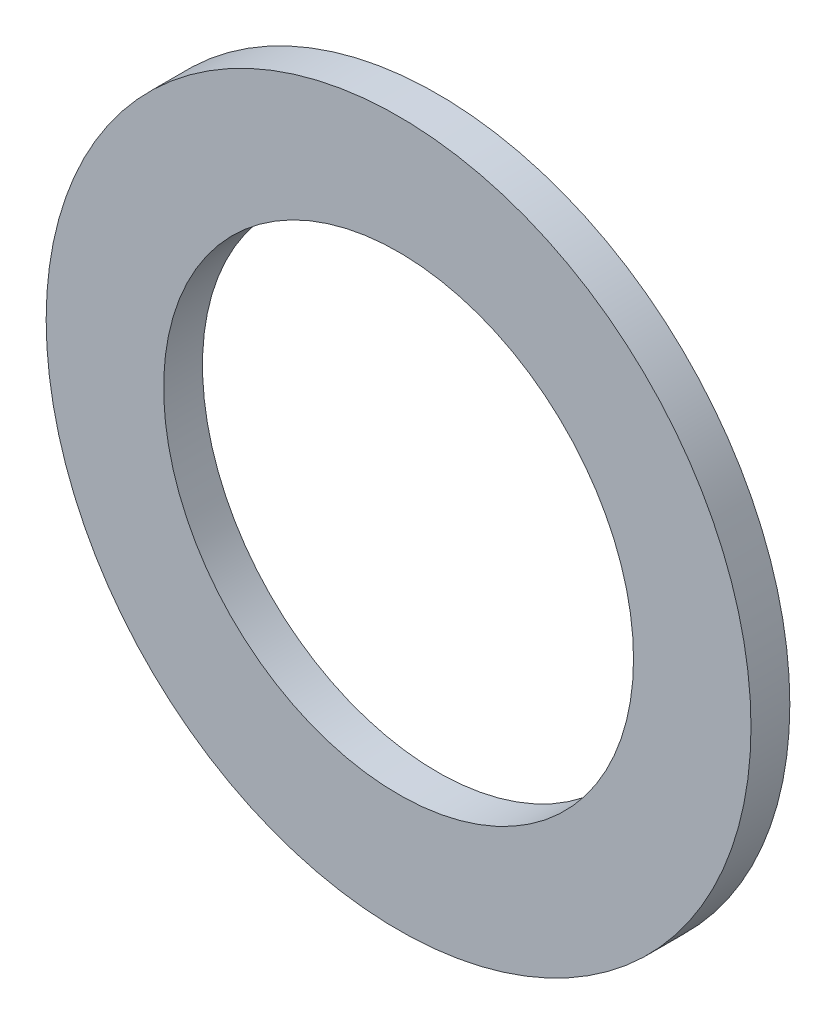
ISO-10303-21;
HEADER;
FILE_DESCRIPTION(('STEP AP214'),'2;1');
FILE_NAME('part.step','',(''),(''),'','','');
FILE_SCHEMA(('AUTOMOTIVE_DESIGN { 1 0 10303 214 1 1 1 1 }'));
ENDSEC;
DATA;
#1=APPLICATION_CONTEXT('core data for automotive mechanical design processes');
#2=APPLICATION_PROTOCOL_DEFINITION('international standard','automotive_design',2000,#1);
#3=PRODUCT_CONTEXT('',#1,'mechanical');
#4=PRODUCT('Part','Part','',(#3));
#5=PRODUCT_RELATED_PRODUCT_CATEGORY('part','',(#4));
#6=PRODUCT_DEFINITION_FORMATION('','',#4);
#7=PRODUCT_DEFINITION_CONTEXT('part definition',#1,'design');
#8=PRODUCT_DEFINITION('design','',#6,#7);
#9=PRODUCT_DEFINITION_SHAPE('','',#8);
#10=(LENGTH_UNIT() NAMED_UNIT(*) SI_UNIT(.MILLI.,.METRE.));
#11=(NAMED_UNIT(*) PLANE_ANGLE_UNIT() SI_UNIT($,.RADIAN.));
#12=(NAMED_UNIT(*) SI_UNIT($,.STERADIAN.) SOLID_ANGLE_UNIT());
#13=UNCERTAINTY_MEASURE_WITH_UNIT(LENGTH_MEASURE(1.E-05),#10,'distance_accuracy_value','');
#14=(GEOMETRIC_REPRESENTATION_CONTEXT(3) GLOBAL_UNCERTAINTY_ASSIGNED_CONTEXT((#13)) GLOBAL_UNIT_ASSIGNED_CONTEXT((#10,
#11,#12)) REPRESENTATION_CONTEXT('',''));
#15=CARTESIAN_POINT('',(0.,0.,0.));
#16=DIRECTION('',(0.,0.,1.));
#17=DIRECTION('',(1.,0.,0.));
#18=AXIS2_PLACEMENT_3D('',#15,#16,#17);
#19=CARTESIAN_POINT('',(0.,0.,1.5748));
#20=DIRECTION('',(0.,0.,1.));
#21=DIRECTION('',(1.,0.,0.));
#22=AXIS2_PLACEMENT_3D('',#19,#20,#21);
#23=PLANE('',#22);
#24=CARTESIAN_POINT('',(0.,0.,1.5748));
#25=DIRECTION('',(0.,0.,1.));
#26=DIRECTION('',(1.,0.,0.));
#27=AXIS2_PLACEMENT_3D('',#24,#25,#26);
#28=CIRCLE('',#27,14.2875);
#29=CARTESIAN_POINT('',(14.2875,0.,1.5748));
#30=VERTEX_POINT('',#29);
#31=EDGE_CURVE('E10',#30,#30,#28,.T.);
#32=ORIENTED_EDGE('',*,*,#31,.T.);
#33=EDGE_LOOP('',(#32));
#34=FACE_BOUND('',#33,.T.);
#35=CARTESIAN_POINT('',(0.,0.,1.5748));
#36=DIRECTION('',(0.,0.,1.));
#37=DIRECTION('',(1.,0.,0.));
#38=AXIS2_PLACEMENT_3D('',#35,#36,#37);
#39=CIRCLE('',#38,9.525);
#40=CARTESIAN_POINT('',(9.525,0.,1.5748));
#41=VERTEX_POINT('',#40);
#42=EDGE_CURVE('E41',#41,#41,#39,.T.);
#43=ORIENTED_EDGE('',*,*,#42,.F.);
#44=EDGE_LOOP('',(#43));
#45=FACE_BOUND('',#44,.T.);
#46=ADVANCED_FACE('F30',(#34,#45),#23,.T.);
#47=CARTESIAN_POINT('',(0.,0.,0.));
#48=DIRECTION('',(0.,0.,1.));
#49=DIRECTION('',(1.,0.,0.));
#50=AXIS2_PLACEMENT_3D('',#47,#48,#49);
#51=PLANE('',#50);
#52=CARTESIAN_POINT('',(0.,0.,0.));
#53=DIRECTION('',(0.,0.,1.));
#54=DIRECTION('',(1.,0.,0.));
#55=AXIS2_PLACEMENT_3D('',#52,#53,#54);
#56=CIRCLE('',#55,14.2875);
#57=CARTESIAN_POINT('',(14.2875,0.,0.));
#58=VERTEX_POINT('',#57);
#59=EDGE_CURVE('E34',#58,#58,#56,.T.);
#60=ORIENTED_EDGE('',*,*,#59,.F.);
#61=EDGE_LOOP('',(#60));
#62=FACE_BOUND('',#61,.T.);
#63=CARTESIAN_POINT('',(0.,0.,0.));
#64=DIRECTION('',(0.,0.,1.));
#65=DIRECTION('',(1.,0.,0.));
#66=AXIS2_PLACEMENT_3D('',#63,#64,#65);
#67=CIRCLE('',#66,9.525);
#68=CARTESIAN_POINT('',(9.525,0.,0.));
#69=VERTEX_POINT('',#68);
#70=EDGE_CURVE('E43',#69,#69,#67,.T.);
#71=ORIENTED_EDGE('',*,*,#70,.T.);
#72=EDGE_LOOP('',(#71));
#73=FACE_BOUND('',#72,.T.);
#74=ADVANCED_FACE('F53',(#62,#73),#51,.F.);
#75=CARTESIAN_POINT('',(0.,0.,1.5748));
#76=DIRECTION('',(0.,0.,-1.));
#77=DIRECTION('',(-1.,0.,0.));
#78=AXIS2_PLACEMENT_3D('',#75,#76,#77);
#79=CYLINDRICAL_SURFACE('',#78,14.2875);
#80=ORIENTED_EDGE('',*,*,#31,.F.);
#81=EDGE_LOOP('',(#80));
#82=FACE_BOUND('',#81,.T.);
#83=ORIENTED_EDGE('',*,*,#59,.T.);
#84=EDGE_LOOP('',(#83));
#85=FACE_BOUND('',#84,.T.);
#86=ADVANCED_FACE('F32',(#82,#85),#79,.T.);
#87=CARTESIAN_POINT('',(0.,0.,1.5748));
#88=DIRECTION('',(0.,0.,-1.));
#89=DIRECTION('',(-1.,0.,0.));
#90=AXIS2_PLACEMENT_3D('',#87,#88,#89);
#91=CYLINDRICAL_SURFACE('',#90,9.525);
#92=ORIENTED_EDGE('',*,*,#42,.T.);
#93=EDGE_LOOP('',(#92));
#94=FACE_BOUND('',#93,.T.);
#95=ORIENTED_EDGE('',*,*,#70,.F.);
#96=EDGE_LOOP('',(#95));
#97=FACE_BOUND('',#96,.T.);
#98=ADVANCED_FACE('F49',(#94,#97),#91,.F.);
#99=CLOSED_SHELL('',(#46,#74,#86,#98));
#100=MANIFOLD_SOLID_BREP('B2',#99);
#101=ADVANCED_BREP_SHAPE_REPRESENTATION('',(#18,#100),#14);
#102=SHAPE_DEFINITION_REPRESENTATION(#9,#101);
ENDSEC;
END-ISO-10303-21;
